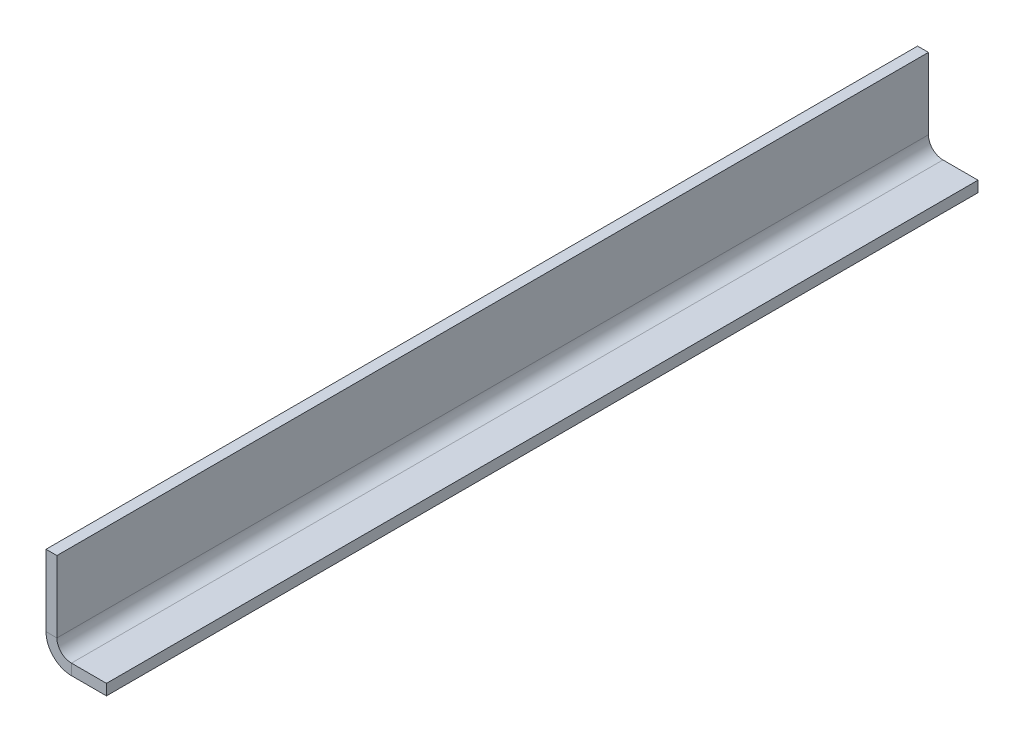
ISO-10303-21;
HEADER;
FILE_DESCRIPTION(('STEP AP214'),'2;1');
FILE_NAME('part.step','',(''),(''),'','','');
FILE_SCHEMA(('AUTOMOTIVE_DESIGN { 1 0 10303 214 1 1 1 1 }'));
ENDSEC;
DATA;
#1=APPLICATION_CONTEXT('core data for automotive mechanical design processes');
#2=APPLICATION_PROTOCOL_DEFINITION('international standard','automotive_design',2000,#1);
#3=PRODUCT_CONTEXT('',#1,'mechanical');
#4=PRODUCT('Part','Part','',(#3));
#5=PRODUCT_RELATED_PRODUCT_CATEGORY('part','',(#4));
#6=PRODUCT_DEFINITION_FORMATION('','',#4);
#7=PRODUCT_DEFINITION_CONTEXT('part definition',#1,'design');
#8=PRODUCT_DEFINITION('design','',#6,#7);
#9=PRODUCT_DEFINITION_SHAPE('','',#8);
#10=(LENGTH_UNIT() NAMED_UNIT(*) SI_UNIT(.MILLI.,.METRE.));
#11=(NAMED_UNIT(*) PLANE_ANGLE_UNIT() SI_UNIT($,.RADIAN.));
#12=(NAMED_UNIT(*) SI_UNIT($,.STERADIAN.) SOLID_ANGLE_UNIT());
#13=UNCERTAINTY_MEASURE_WITH_UNIT(LENGTH_MEASURE(1.E-05),#10,'distance_accuracy_value','');
#14=(GEOMETRIC_REPRESENTATION_CONTEXT(3) GLOBAL_UNCERTAINTY_ASSIGNED_CONTEXT((#13)) GLOBAL_UNIT_ASSIGNED_CONTEXT((#10,
#11,#12)) REPRESENTATION_CONTEXT('',''));
#15=CARTESIAN_POINT('',(0.,0.,0.));
#16=DIRECTION('',(0.,0.,1.));
#17=DIRECTION('',(1.,0.,0.));
#18=AXIS2_PLACEMENT_3D('',#15,#16,#17);
#19=CARTESIAN_POINT('',(3.175,3.175,0.));
#20=DIRECTION('',(0.,0.,1.));
#21=DIRECTION('',(0.,1.,0.));
#22=AXIS2_PLACEMENT_3D('',#19,#20,#21);
#23=PLANE('',#22);
#24=DIRECTION('',(1.,0.,0.));
#25=VECTOR('',#24,1.);
#26=CARTESIAN_POINT('',(3.175,5.175,0.));
#27=LINE('',#26,#25);
#28=CARTESIAN_POINT('',(1.675,5.175,0.));
#29=VERTEX_POINT('',#28);
#30=CARTESIAN_POINT('',(3.175,5.175,0.));
#31=VERTEX_POINT('',#30);
#32=EDGE_CURVE('E11',#29,#31,#27,.T.);
#33=ORIENTED_EDGE('',*,*,#32,.F.);
#34=DIRECTION('',(0.,-1.,0.));
#35=VECTOR('',#34,1.);
#36=CARTESIAN_POINT('',(1.675,3.175,0.));
#37=LINE('',#36,#35);
#38=CARTESIAN_POINT('',(1.675,15.,0.));
#39=VERTEX_POINT('',#38);
#40=EDGE_CURVE('E93',#29,#39,#37,.F.);
#41=ORIENTED_EDGE('',*,*,#40,.T.);
#42=DIRECTION('',(1.,0.,0.));
#43=VECTOR('',#42,1.);
#44=CARTESIAN_POINT('',(3.175,15.,0.));
#45=LINE('',#44,#43);
#46=CARTESIAN_POINT('',(3.175,15.,0.));
#47=VERTEX_POINT('',#46);
#48=EDGE_CURVE('E53',#39,#47,#45,.T.);
#49=ORIENTED_EDGE('',*,*,#48,.T.);
#50=DIRECTION('',(0.,1.,0.));
#51=VECTOR('',#50,1.);
#52=CARTESIAN_POINT('',(3.175,3.175,0.));
#53=LINE('',#52,#51);
#54=EDGE_CURVE('E96',#31,#47,#53,.T.);
#55=ORIENTED_EDGE('',*,*,#54,.F.);
#56=EDGE_LOOP('',(#33,#41,#49,#55));
#57=FACE_BOUND('',#56,.T.);
#58=ADVANCED_FACE('F43',(#57),#23,.F.);
#59=CARTESIAN_POINT('',(3.175,15.,120.));
#60=DIRECTION('',(0.,1.,0.));
#61=DIRECTION('',(0.,0.,-1.));
#62=AXIS2_PLACEMENT_3D('',#59,#60,#61);
#63=PLANE('',#62);
#64=ORIENTED_EDGE('',*,*,#48,.F.);
#65=DIRECTION('',(0.,0.,1.));
#66=VECTOR('',#65,1.);
#67=CARTESIAN_POINT('',(1.675,15.,120.));
#68=LINE('',#67,#66);
#69=CARTESIAN_POINT('',(1.675,15.,120.));
#70=VERTEX_POINT('',#69);
#71=EDGE_CURVE('E121',#70,#39,#68,.F.);
#72=ORIENTED_EDGE('',*,*,#71,.F.);
#73=DIRECTION('',(1.,0.,0.));
#74=VECTOR('',#73,1.);
#75=CARTESIAN_POINT('',(3.175,15.,120.));
#76=LINE('',#75,#74);
#77=CARTESIAN_POINT('',(3.175,15.,120.));
#78=VERTEX_POINT('',#77);
#79=EDGE_CURVE('E139',#70,#78,#76,.T.);
#80=ORIENTED_EDGE('',*,*,#79,.T.);
#81=DIRECTION('',(0.,0.,-1.));
#82=VECTOR('',#81,1.);
#83=CARTESIAN_POINT('',(3.175,15.,120.));
#84=LINE('',#83,#82);
#85=EDGE_CURVE('E150',#78,#47,#84,.T.);
#86=ORIENTED_EDGE('',*,*,#85,.T.);
#87=EDGE_LOOP('',(#64,#72,#80,#86));
#88=FACE_BOUND('',#87,.T.);
#89=ADVANCED_FACE('F156',(#88),#63,.T.);
#90=CARTESIAN_POINT('',(3.175,3.175,120.));
#91=DIRECTION('',(0.,0.,1.));
#92=DIRECTION('',(0.,1.,0.));
#93=AXIS2_PLACEMENT_3D('',#90,#91,#92);
#94=PLANE('',#93);
#95=ORIENTED_EDGE('',*,*,#79,.F.);
#96=DIRECTION('',(0.,-1.,0.));
#97=VECTOR('',#96,1.);
#98=CARTESIAN_POINT('',(1.675,3.175,120.));
#99=LINE('',#98,#97);
#100=CARTESIAN_POINT('',(1.675,5.175,120.));
#101=VERTEX_POINT('',#100);
#102=EDGE_CURVE('E181',#101,#70,#99,.F.);
#103=ORIENTED_EDGE('',*,*,#102,.F.);
#104=DIRECTION('',(1.,0.,0.));
#105=VECTOR('',#104,1.);
#106=CARTESIAN_POINT('',(3.175,5.175,120.));
#107=LINE('',#106,#105);
#108=CARTESIAN_POINT('',(3.175,5.175,120.));
#109=VERTEX_POINT('',#108);
#110=EDGE_CURVE('E136',#101,#109,#107,.T.);
#111=ORIENTED_EDGE('',*,*,#110,.T.);
#112=DIRECTION('',(0.,1.,0.));
#113=VECTOR('',#112,1.);
#114=CARTESIAN_POINT('',(3.175,3.175,120.));
#115=LINE('',#114,#113);
#116=EDGE_CURVE('E157',#109,#78,#115,.T.);
#117=ORIENTED_EDGE('',*,*,#116,.T.);
#118=EDGE_LOOP('',(#95,#103,#111,#117));
#119=FACE_BOUND('',#118,.T.);
#120=ADVANCED_FACE('F187',(#119),#94,.T.);
#121=CARTESIAN_POINT('',(5.175,5.175,120.));
#122=DIRECTION('',(0.,0.,1.));
#123=DIRECTION('',(1.,0.,0.));
#124=AXIS2_PLACEMENT_3D('',#121,#122,#123);
#125=PLANE('',#124);
#126=ORIENTED_EDGE('',*,*,#110,.F.);
#127=CARTESIAN_POINT('',(5.175,5.175,120.));
#128=DIRECTION('',(0.,0.,1.));
#129=DIRECTION('',(1.,0.,0.));
#130=AXIS2_PLACEMENT_3D('',#127,#128,#129);
#131=CIRCLE('',#130,3.5);
#132=CARTESIAN_POINT('',(5.17500000000001,1.675,120.));
#133=VERTEX_POINT('',#132);
#134=EDGE_CURVE('E111',#101,#133,#131,.T.);
#135=ORIENTED_EDGE('',*,*,#134,.T.);
#136=DIRECTION('',(0.,1.,0.));
#137=VECTOR('',#136,1.);
#138=CARTESIAN_POINT('',(5.175,3.175,120.));
#139=LINE('',#138,#137);
#140=CARTESIAN_POINT('',(5.175,3.175,120.));
#141=VERTEX_POINT('',#140);
#142=EDGE_CURVE('E61',#133,#141,#139,.T.);
#143=ORIENTED_EDGE('',*,*,#142,.T.);
#144=CARTESIAN_POINT('',(5.175,5.175,120.));
#145=DIRECTION('',(0.,0.,-1.));
#146=DIRECTION('',(-1.,0.,0.));
#147=AXIS2_PLACEMENT_3D('',#144,#145,#146);
#148=CIRCLE('',#147,2.);
#149=EDGE_CURVE('E154',#109,#141,#148,.F.);
#150=ORIENTED_EDGE('',*,*,#149,.F.);
#151=EDGE_LOOP('',(#126,#135,#143,#150));
#152=FACE_BOUND('',#151,.T.);
#153=ADVANCED_FACE('F190',(#152),#125,.T.);
#154=CARTESIAN_POINT('',(10.,3.175,120.));
#155=DIRECTION('',(0.,0.,1.));
#156=DIRECTION('',(-1.,0.,0.));
#157=AXIS2_PLACEMENT_3D('',#154,#155,#156);
#158=PLANE('',#157);
#159=ORIENTED_EDGE('',*,*,#142,.F.);
#160=DIRECTION('',(1.,0.,0.));
#161=VECTOR('',#160,1.);
#162=CARTESIAN_POINT('',(10.,1.675,120.));
#163=LINE('',#162,#161);
#164=CARTESIAN_POINT('',(10.,1.675,120.));
#165=VERTEX_POINT('',#164);
#166=EDGE_CURVE('E180',#165,#133,#163,.F.);
#167=ORIENTED_EDGE('',*,*,#166,.F.);
#168=DIRECTION('',(0.,1.,0.));
#169=VECTOR('',#168,1.);
#170=CARTESIAN_POINT('',(10.,3.175,120.));
#171=LINE('',#170,#169);
#172=CARTESIAN_POINT('',(10.,3.175,120.));
#173=VERTEX_POINT('',#172);
#174=EDGE_CURVE('E132',#165,#173,#171,.T.);
#175=ORIENTED_EDGE('',*,*,#174,.T.);
#176=DIRECTION('',(-1.,0.,0.));
#177=VECTOR('',#176,1.);
#178=CARTESIAN_POINT('',(10.,3.175,120.));
#179=LINE('',#178,#177);
#180=EDGE_CURVE('E164',#173,#141,#179,.T.);
#181=ORIENTED_EDGE('',*,*,#180,.T.);
#182=EDGE_LOOP('',(#159,#167,#175,#181));
#183=FACE_BOUND('',#182,.T.);
#184=ADVANCED_FACE('F201',(#183),#158,.T.);
#185=CARTESIAN_POINT('',(10.,3.175,120.));
#186=DIRECTION('',(-1.,0.,0.));
#187=DIRECTION('',(0.,0.,-1.));
#188=AXIS2_PLACEMENT_3D('',#185,#186,#187);
#189=PLANE('',#188);
#190=ORIENTED_EDGE('',*,*,#174,.F.);
#191=DIRECTION('',(0.,0.,1.));
#192=VECTOR('',#191,1.);
#193=CARTESIAN_POINT('',(10.,1.675,120.));
#194=LINE('',#193,#192);
#195=CARTESIAN_POINT('',(10.,1.675,0.));
#196=VERTEX_POINT('',#195);
#197=EDGE_CURVE('E116',#165,#196,#194,.F.);
#198=ORIENTED_EDGE('',*,*,#197,.T.);
#199=DIRECTION('',(0.,1.,0.));
#200=VECTOR('',#199,1.);
#201=CARTESIAN_POINT('',(10.,3.175,0.));
#202=LINE('',#201,#200);
#203=CARTESIAN_POINT('',(10.,3.175,0.));
#204=VERTEX_POINT('',#203);
#205=EDGE_CURVE('E129',#196,#204,#202,.T.);
#206=ORIENTED_EDGE('',*,*,#205,.T.);
#207=DIRECTION('',(0.,0.,-1.));
#208=VECTOR('',#207,1.);
#209=CARTESIAN_POINT('',(10.,3.175,120.));
#210=LINE('',#209,#208);
#211=EDGE_CURVE('E167',#173,#204,#210,.T.);
#212=ORIENTED_EDGE('',*,*,#211,.F.);
#213=EDGE_LOOP('',(#190,#198,#206,#212));
#214=FACE_BOUND('',#213,.T.);
#215=ADVANCED_FACE('F207',(#214),#189,.F.);
#216=CARTESIAN_POINT('',(10.,3.175,0.));
#217=DIRECTION('',(0.,0.,1.));
#218=DIRECTION('',(-1.,0.,0.));
#219=AXIS2_PLACEMENT_3D('',#216,#217,#218);
#220=PLANE('',#219);
#221=ORIENTED_EDGE('',*,*,#205,.F.);
#222=DIRECTION('',(1.,0.,0.));
#223=VECTOR('',#222,1.);
#224=CARTESIAN_POINT('',(10.,1.675,0.));
#225=LINE('',#224,#223);
#226=CARTESIAN_POINT('',(5.175,1.675,0.));
#227=VERTEX_POINT('',#226);
#228=EDGE_CURVE('E178',#196,#227,#225,.F.);
#229=ORIENTED_EDGE('',*,*,#228,.T.);
#230=DIRECTION('',(0.,1.,0.));
#231=VECTOR('',#230,1.);
#232=CARTESIAN_POINT('',(5.175,3.175,0.));
#233=LINE('',#232,#231);
#234=CARTESIAN_POINT('',(5.175,3.175,0.));
#235=VERTEX_POINT('',#234);
#236=EDGE_CURVE('E47',#227,#235,#233,.T.);
#237=ORIENTED_EDGE('',*,*,#236,.T.);
#238=DIRECTION('',(-1.,0.,0.));
#239=VECTOR('',#238,1.);
#240=CARTESIAN_POINT('',(10.,3.175,0.));
#241=LINE('',#240,#239);
#242=EDGE_CURVE('E159',#204,#235,#241,.T.);
#243=ORIENTED_EDGE('',*,*,#242,.F.);
#244=EDGE_LOOP('',(#221,#229,#237,#243));
#245=FACE_BOUND('',#244,.T.);
#246=ADVANCED_FACE('F211',(#245),#220,.F.);
#247=CARTESIAN_POINT('',(5.175,5.175,0.));
#248=DIRECTION('',(0.,0.,-1.));
#249=DIRECTION('',(-1.,0.,0.));
#250=AXIS2_PLACEMENT_3D('',#247,#248,#249);
#251=PLANE('',#250);
#252=CARTESIAN_POINT('',(5.175,5.175,0.));
#253=DIRECTION('',(0.,0.,1.));
#254=DIRECTION('',(1.,0.,0.));
#255=AXIS2_PLACEMENT_3D('',#252,#253,#254);
#256=CIRCLE('',#255,3.5);
#257=EDGE_CURVE('E109',#227,#29,#256,.F.);
#258=ORIENTED_EDGE('',*,*,#257,.T.);
#259=ORIENTED_EDGE('',*,*,#32,.T.);
#260=CARTESIAN_POINT('',(5.175,5.175,0.));
#261=DIRECTION('',(0.,0.,1.));
#262=DIRECTION('',(1.,0.,0.));
#263=AXIS2_PLACEMENT_3D('',#260,#261,#262);
#264=CIRCLE('',#263,2.);
#265=EDGE_CURVE('E174',#235,#31,#264,.F.);
#266=ORIENTED_EDGE('',*,*,#265,.F.);
#267=ORIENTED_EDGE('',*,*,#236,.F.);
#268=EDGE_LOOP('',(#258,#259,#266,#267));
#269=FACE_BOUND('',#268,.T.);
#270=ADVANCED_FACE('F45',(#269),#251,.T.);
#271=CARTESIAN_POINT('',(10.,3.175,120.));
#272=DIRECTION('',(0.,-1.,0.));
#273=DIRECTION('',(1.,0.,0.));
#274=AXIS2_PLACEMENT_3D('',#271,#272,#273);
#275=PLANE('',#274);
#276=ORIENTED_EDGE('',*,*,#242,.T.);
#277=DIRECTION('',(0.,0.,-1.));
#278=VECTOR('',#277,1.);
#279=CARTESIAN_POINT('',(5.175,3.175,120.));
#280=LINE('',#279,#278);
#281=EDGE_CURVE('E171',#235,#141,#280,.F.);
#282=ORIENTED_EDGE('',*,*,#281,.T.);
#283=ORIENTED_EDGE('',*,*,#180,.F.);
#284=ORIENTED_EDGE('',*,*,#211,.T.);
#285=EDGE_LOOP('',(#276,#282,#283,#284));
#286=FACE_BOUND('',#285,.T.);
#287=ADVANCED_FACE('F206',(#286),#275,.F.);
#288=CARTESIAN_POINT('',(3.175,3.175,120.));
#289=DIRECTION('',(-1.,0.,0.));
#290=DIRECTION('',(0.,-1.,0.));
#291=AXIS2_PLACEMENT_3D('',#288,#289,#290);
#292=PLANE('',#291);
#293=ORIENTED_EDGE('',*,*,#116,.F.);
#294=DIRECTION('',(0.,0.,-1.));
#295=VECTOR('',#294,1.);
#296=CARTESIAN_POINT('',(3.175,5.175,0.));
#297=LINE('',#296,#295);
#298=EDGE_CURVE('E153',#109,#31,#297,.T.);
#299=ORIENTED_EDGE('',*,*,#298,.T.);
#300=ORIENTED_EDGE('',*,*,#54,.T.);
#301=ORIENTED_EDGE('',*,*,#85,.F.);
#302=EDGE_LOOP('',(#293,#299,#300,#301));
#303=FACE_BOUND('',#302,.T.);
#304=ADVANCED_FACE('F149',(#303),#292,.F.);
#305=CARTESIAN_POINT('',(5.175,5.175,120.));
#306=DIRECTION('',(0.,0.,1.));
#307=DIRECTION('',(1.,0.,0.));
#308=AXIS2_PLACEMENT_3D('',#305,#306,#307);
#309=CYLINDRICAL_SURFACE('',#308,2.);
#310=ORIENTED_EDGE('',*,*,#149,.T.);
#311=ORIENTED_EDGE('',*,*,#281,.F.);
#312=ORIENTED_EDGE('',*,*,#265,.T.);
#313=ORIENTED_EDGE('',*,*,#298,.F.);
#314=EDGE_LOOP('',(#310,#311,#312,#313));
#315=FACE_BOUND('',#314,.T.);
#316=ADVANCED_FACE('F193',(#315),#309,.F.);
#317=CARTESIAN_POINT('',(10.,1.675,120.));
#318=DIRECTION('',(0.,-1.,0.));
#319=DIRECTION('',(1.,0.,0.));
#320=AXIS2_PLACEMENT_3D('',#317,#318,#319);
#321=PLANE('',#320);
#322=ORIENTED_EDGE('',*,*,#228,.F.);
#323=ORIENTED_EDGE('',*,*,#197,.F.);
#324=ORIENTED_EDGE('',*,*,#166,.T.);
#325=DIRECTION('',(0.,0.,1.));
#326=VECTOR('',#325,1.);
#327=CARTESIAN_POINT('',(5.175,1.675,120.));
#328=LINE('',#327,#326);
#329=EDGE_CURVE('E115',#227,#133,#328,.T.);
#330=ORIENTED_EDGE('',*,*,#329,.F.);
#331=EDGE_LOOP('',(#322,#323,#324,#330));
#332=FACE_BOUND('',#331,.T.);
#333=ADVANCED_FACE('F213',(#332),#321,.T.);
#334=CARTESIAN_POINT('',(1.675,3.175,120.));
#335=DIRECTION('',(-1.,0.,0.));
#336=DIRECTION('',(0.,-1.,0.));
#337=AXIS2_PLACEMENT_3D('',#334,#335,#336);
#338=PLANE('',#337);
#339=ORIENTED_EDGE('',*,*,#102,.T.);
#340=ORIENTED_EDGE('',*,*,#71,.T.);
#341=ORIENTED_EDGE('',*,*,#40,.F.);
#342=DIRECTION('',(0.,0.,1.));
#343=VECTOR('',#342,1.);
#344=CARTESIAN_POINT('',(1.675,5.175,120.));
#345=LINE('',#344,#343);
#346=EDGE_CURVE('E106',#101,#29,#345,.F.);
#347=ORIENTED_EDGE('',*,*,#346,.F.);
#348=EDGE_LOOP('',(#339,#340,#341,#347));
#349=FACE_BOUND('',#348,.T.);
#350=ADVANCED_FACE('F119',(#349),#338,.T.);
#351=CARTESIAN_POINT('',(5.175,5.175,120.));
#352=DIRECTION('',(0.,0.,1.));
#353=DIRECTION('',(1.,0.,0.));
#354=AXIS2_PLACEMENT_3D('',#351,#352,#353);
#355=CYLINDRICAL_SURFACE('',#354,3.5);
#356=ORIENTED_EDGE('',*,*,#134,.F.);
#357=ORIENTED_EDGE('',*,*,#346,.T.);
#358=ORIENTED_EDGE('',*,*,#257,.F.);
#359=ORIENTED_EDGE('',*,*,#329,.T.);
#360=EDGE_LOOP('',(#356,#357,#358,#359));
#361=FACE_BOUND('',#360,.T.);
#362=ADVANCED_FACE('F107',(#361),#355,.T.);
#363=CLOSED_SHELL('',(#58,#89,#120,#153,#184,#215,#246,#270,#287,#304,#316,#333,#350,#362));
#364=MANIFOLD_SOLID_BREP('B2',#363);
#365=ADVANCED_BREP_SHAPE_REPRESENTATION('',(#18,#364),#14);
#366=SHAPE_DEFINITION_REPRESENTATION(#9,#365);
ENDSEC;
END-ISO-10303-21;
